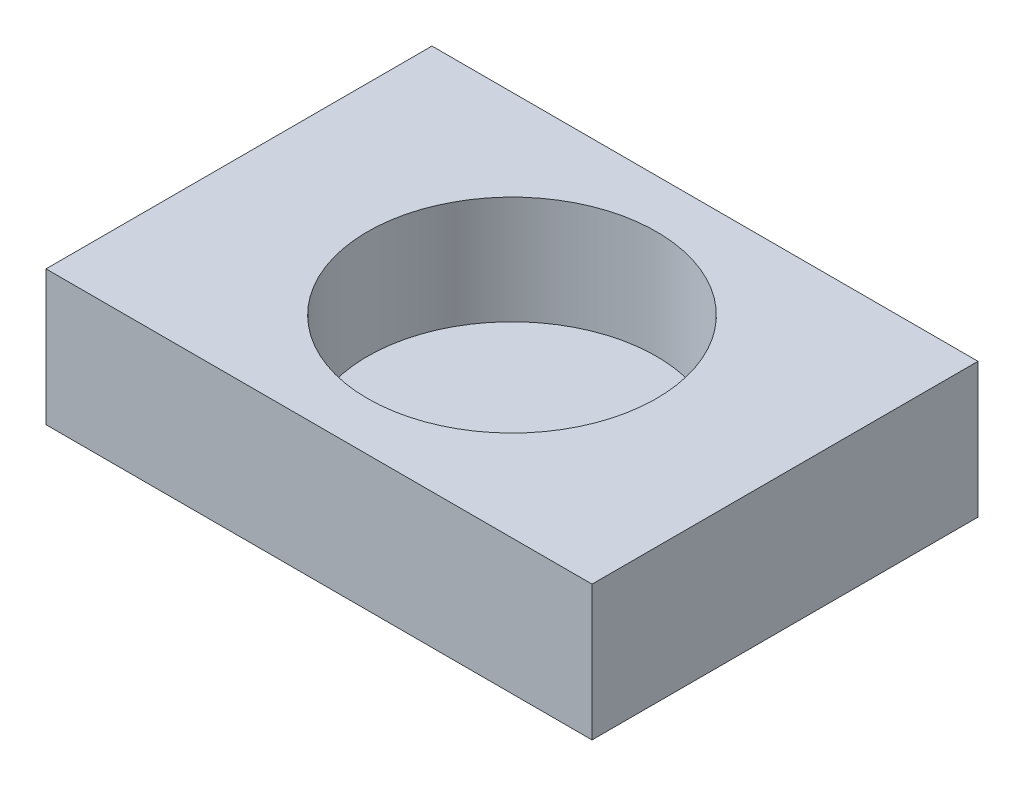
ISO-10303-21;
HEADER;
FILE_DESCRIPTION(('STEP AP214'),'2;1');
FILE_NAME('part.step','',(''),(''),'','','');
FILE_SCHEMA(('AUTOMOTIVE_DESIGN { 1 0 10303 214 1 1 1 1 }'));
ENDSEC;
DATA;
#1=APPLICATION_CONTEXT('core data for automotive mechanical design processes');
#2=APPLICATION_PROTOCOL_DEFINITION('international standard','automotive_design',2000,#1);
#3=PRODUCT_CONTEXT('',#1,'mechanical');
#4=PRODUCT('Part','Part','',(#3));
#5=PRODUCT_RELATED_PRODUCT_CATEGORY('part','',(#4));
#6=PRODUCT_DEFINITION_FORMATION('','',#4);
#7=PRODUCT_DEFINITION_CONTEXT('part definition',#1,'design');
#8=PRODUCT_DEFINITION('design','',#6,#7);
#9=PRODUCT_DEFINITION_SHAPE('','',#8);
#10=(LENGTH_UNIT() NAMED_UNIT(*) SI_UNIT(.MILLI.,.METRE.));
#11=(NAMED_UNIT(*) PLANE_ANGLE_UNIT() SI_UNIT($,.RADIAN.));
#12=(NAMED_UNIT(*) SI_UNIT($,.STERADIAN.) SOLID_ANGLE_UNIT());
#13=UNCERTAINTY_MEASURE_WITH_UNIT(LENGTH_MEASURE(1.E-05),#10,'distance_accuracy_value','');
#14=(GEOMETRIC_REPRESENTATION_CONTEXT(3) GLOBAL_UNCERTAINTY_ASSIGNED_CONTEXT((#13)) GLOBAL_UNIT_ASSIGNED_CONTEXT((#10,
#11,#12)) REPRESENTATION_CONTEXT('',''));
#15=CARTESIAN_POINT('',(0.,0.,0.));
#16=DIRECTION('',(0.,0.,1.));
#17=DIRECTION('',(1.,0.,0.));
#18=AXIS2_PLACEMENT_3D('',#15,#16,#17);
#19=CARTESIAN_POINT('',(-101.145528537315,50.,-71.4945));
#20=DIRECTION('',(1.,0.,0.));
#21=DIRECTION('',(0.,0.,-1.));
#22=AXIS2_PLACEMENT_3D('',#19,#20,#21);
#23=PLANE('',#22);
#24=DIRECTION('',(0.,0.,1.));
#25=VECTOR('',#24,1.);
#26=CARTESIAN_POINT('',(-101.145528537315,0.,-71.4945));
#27=LINE('',#26,#25);
#28=CARTESIAN_POINT('',(-101.145528537315,0.,-71.4945));
#29=VERTEX_POINT('',#28);
#30=CARTESIAN_POINT('',(-101.145528537315,0.,71.4945));
#31=VERTEX_POINT('',#30);
#32=EDGE_CURVE('E101',#29,#31,#27,.T.);
#33=ORIENTED_EDGE('',*,*,#32,.T.);
#34=DIRECTION('',(0.,-1.,0.));
#35=VECTOR('',#34,1.);
#36=CARTESIAN_POINT('',(-101.145528537315,50.,71.4945));
#37=LINE('',#36,#35);
#38=CARTESIAN_POINT('',(-101.145528537315,50.,71.4945));
#39=VERTEX_POINT('',#38);
#40=EDGE_CURVE('E11',#39,#31,#37,.T.);
#41=ORIENTED_EDGE('',*,*,#40,.F.);
#42=DIRECTION('',(0.,0.,1.));
#43=VECTOR('',#42,1.);
#44=CARTESIAN_POINT('',(-101.145528537315,50.,-71.4945));
#45=LINE('',#44,#43);
#46=CARTESIAN_POINT('',(-101.145528537315,50.,-71.4945));
#47=VERTEX_POINT('',#46);
#48=EDGE_CURVE('E89',#47,#39,#45,.T.);
#49=ORIENTED_EDGE('',*,*,#48,.F.);
#50=DIRECTION('',(0.,-1.,0.));
#51=VECTOR('',#50,1.);
#52=CARTESIAN_POINT('',(-101.145528537315,50.,-71.4945));
#53=LINE('',#52,#51);
#54=EDGE_CURVE('E97',#47,#29,#53,.T.);
#55=ORIENTED_EDGE('',*,*,#54,.T.);
#56=EDGE_LOOP('',(#33,#41,#49,#55));
#57=FACE_BOUND('',#56,.T.);
#58=ADVANCED_FACE('F38',(#57),#23,.F.);
#59=CARTESIAN_POINT('',(101.145528537315,50.,71.4945));
#60=DIRECTION('',(0.,0.,-1.));
#61=DIRECTION('',(-1.,0.,0.));
#62=AXIS2_PLACEMENT_3D('',#59,#60,#61);
#63=PLANE('',#62);
#64=DIRECTION('',(1.,0.,0.));
#65=VECTOR('',#64,1.);
#66=CARTESIAN_POINT('',(101.145528537315,0.,71.4945));
#67=LINE('',#66,#65);
#68=CARTESIAN_POINT('',(101.145528537315,0.,71.4945));
#69=VERTEX_POINT('',#68);
#70=EDGE_CURVE('E93',#31,#69,#67,.T.);
#71=ORIENTED_EDGE('',*,*,#70,.T.);
#72=DIRECTION('',(0.,-1.,0.));
#73=VECTOR('',#72,1.);
#74=CARTESIAN_POINT('',(101.145528537315,50.,71.4945));
#75=LINE('',#74,#73);
#76=CARTESIAN_POINT('',(101.145528537315,50.,71.4945));
#77=VERTEX_POINT('',#76);
#78=EDGE_CURVE('E46',#77,#69,#75,.T.);
#79=ORIENTED_EDGE('',*,*,#78,.F.);
#80=DIRECTION('',(1.,0.,0.));
#81=VECTOR('',#80,1.);
#82=CARTESIAN_POINT('',(101.145528537315,50.,71.4945));
#83=LINE('',#82,#81);
#84=EDGE_CURVE('E84',#39,#77,#83,.T.);
#85=ORIENTED_EDGE('',*,*,#84,.F.);
#86=ORIENTED_EDGE('',*,*,#40,.T.);
#87=EDGE_LOOP('',(#71,#79,#85,#86));
#88=FACE_BOUND('',#87,.T.);
#89=ADVANCED_FACE('F92',(#88),#63,.F.);
#90=CARTESIAN_POINT('',(101.145528537315,50.,-71.4945));
#91=DIRECTION('',(-1.,0.,0.));
#92=DIRECTION('',(0.,0.,1.));
#93=AXIS2_PLACEMENT_3D('',#90,#91,#92);
#94=PLANE('',#93);
#95=DIRECTION('',(0.,0.,-1.));
#96=VECTOR('',#95,1.);
#97=CARTESIAN_POINT('',(101.145528537315,0.,-71.4945));
#98=LINE('',#97,#96);
#99=CARTESIAN_POINT('',(101.145528537315,0.,-71.4945));
#100=VERTEX_POINT('',#99);
#101=EDGE_CURVE('E71',#69,#100,#98,.T.);
#102=ORIENTED_EDGE('',*,*,#101,.T.);
#103=DIRECTION('',(0.,-1.,0.));
#104=VECTOR('',#103,1.);
#105=CARTESIAN_POINT('',(101.145528537315,50.,-71.4945));
#106=LINE('',#105,#104);
#107=CARTESIAN_POINT('',(101.145528537315,50.,-71.4945));
#108=VERTEX_POINT('',#107);
#109=EDGE_CURVE('E94',#108,#100,#106,.T.);
#110=ORIENTED_EDGE('',*,*,#109,.F.);
#111=DIRECTION('',(0.,0.,-1.));
#112=VECTOR('',#111,1.);
#113=CARTESIAN_POINT('',(101.145528537315,50.,-71.4945));
#114=LINE('',#113,#112);
#115=EDGE_CURVE('E87',#77,#108,#114,.T.);
#116=ORIENTED_EDGE('',*,*,#115,.F.);
#117=ORIENTED_EDGE('',*,*,#78,.T.);
#118=EDGE_LOOP('',(#102,#110,#116,#117));
#119=FACE_BOUND('',#118,.T.);
#120=ADVANCED_FACE('F95',(#119),#94,.F.);
#121=CARTESIAN_POINT('',(101.145528537315,50.,-71.4945));
#122=DIRECTION('',(0.,0.,1.));
#123=DIRECTION('',(1.,0.,0.));
#124=AXIS2_PLACEMENT_3D('',#121,#122,#123);
#125=PLANE('',#124);
#126=DIRECTION('',(-1.,0.,0.));
#127=VECTOR('',#126,1.);
#128=CARTESIAN_POINT('',(101.145528537315,0.,-71.4945));
#129=LINE('',#128,#127);
#130=EDGE_CURVE('E77',#100,#29,#129,.T.);
#131=ORIENTED_EDGE('',*,*,#130,.T.);
#132=ORIENTED_EDGE('',*,*,#54,.F.);
#133=DIRECTION('',(-1.,0.,0.));
#134=VECTOR('',#133,1.);
#135=CARTESIAN_POINT('',(101.145528537315,50.,-71.4945));
#136=LINE('',#135,#134);
#137=EDGE_CURVE('E54',#108,#47,#136,.T.);
#138=ORIENTED_EDGE('',*,*,#137,.F.);
#139=ORIENTED_EDGE('',*,*,#109,.T.);
#140=EDGE_LOOP('',(#131,#132,#138,#139));
#141=FACE_BOUND('',#140,.T.);
#142=ADVANCED_FACE('F109',(#141),#125,.F.);
#143=CARTESIAN_POINT('',(0.,50.,0.));
#144=DIRECTION('',(0.,-1.,0.));
#145=DIRECTION('',(0.,0.,-1.));
#146=AXIS2_PLACEMENT_3D('',#143,#144,#145);
#147=PLANE('',#146);
#148=CARTESIAN_POINT('',(0.,50.,0.));
#149=DIRECTION('',(0.,1.,0.));
#150=DIRECTION('',(0.,0.,1.));
#151=AXIS2_PLACEMENT_3D('',#148,#149,#150);
#152=CIRCLE('',#151,53.540101);
#153=CARTESIAN_POINT('',(0.,50.,53.540101));
#154=VERTEX_POINT('',#153);
#155=EDGE_CURVE('E115',#154,#154,#152,.T.);
#156=ORIENTED_EDGE('',*,*,#155,.F.);
#157=EDGE_LOOP('',(#156));
#158=FACE_BOUND('',#157,.T.);
#159=ORIENTED_EDGE('',*,*,#48,.T.);
#160=ORIENTED_EDGE('',*,*,#84,.T.);
#161=ORIENTED_EDGE('',*,*,#115,.T.);
#162=ORIENTED_EDGE('',*,*,#137,.T.);
#163=EDGE_LOOP('',(#159,#160,#161,#162));
#164=FACE_BOUND('',#163,.T.);
#165=ADVANCED_FACE('F85',(#158,#164),#147,.F.);
#166=CARTESIAN_POINT('',(0.,0.,0.));
#167=DIRECTION('',(0.,-1.,0.));
#168=DIRECTION('',(0.,0.,-1.));
#169=AXIS2_PLACEMENT_3D('',#166,#167,#168);
#170=PLANE('',#169);
#171=ORIENTED_EDGE('',*,*,#32,.F.);
#172=ORIENTED_EDGE('',*,*,#130,.F.);
#173=ORIENTED_EDGE('',*,*,#101,.F.);
#174=ORIENTED_EDGE('',*,*,#70,.F.);
#175=EDGE_LOOP('',(#171,#172,#173,#174));
#176=FACE_BOUND('',#175,.T.);
#177=ADVANCED_FACE('F112',(#176),#170,.T.);
#178=CARTESIAN_POINT('',(0.,10.,0.));
#179=DIRECTION('',(0.,1.,0.));
#180=DIRECTION('',(0.,0.,1.));
#181=AXIS2_PLACEMENT_3D('',#178,#179,#180);
#182=CYLINDRICAL_SURFACE('',#181,53.540101);
#183=CARTESIAN_POINT('',(0.,10.,0.));
#184=DIRECTION('',(0.,1.,0.));
#185=DIRECTION('',(0.,0.,1.));
#186=AXIS2_PLACEMENT_3D('',#183,#184,#185);
#187=CIRCLE('',#186,53.540101);
#188=CARTESIAN_POINT('',(0.,10.,53.540101));
#189=VERTEX_POINT('',#188);
#190=EDGE_CURVE('E104',#189,#189,#187,.T.);
#191=ORIENTED_EDGE('',*,*,#190,.F.);
#192=EDGE_LOOP('',(#191));
#193=FACE_BOUND('',#192,.T.);
#194=ORIENTED_EDGE('',*,*,#155,.T.);
#195=EDGE_LOOP('',(#194));
#196=FACE_BOUND('',#195,.T.);
#197=ADVANCED_FACE('F123',(#193,#196),#182,.F.);
#198=CARTESIAN_POINT('',(0.,10.,0.));
#199=DIRECTION('',(0.,1.,0.));
#200=DIRECTION('',(0.,0.,1.));
#201=AXIS2_PLACEMENT_3D('',#198,#199,#200);
#202=PLANE('',#201);
#203=ORIENTED_EDGE('',*,*,#190,.T.);
#204=EDGE_LOOP('',(#203));
#205=FACE_BOUND('',#204,.T.);
#206=ADVANCED_FACE('F121',(#205),#202,.T.);
#207=CLOSED_SHELL('',(#58,#89,#120,#142,#165,#177,#197,#206));
#208=MANIFOLD_SOLID_BREP('B2',#207);
#209=ADVANCED_BREP_SHAPE_REPRESENTATION('',(#18,#208),#14);
#210=SHAPE_DEFINITION_REPRESENTATION(#9,#209);
ENDSEC;
END-ISO-10303-21;
